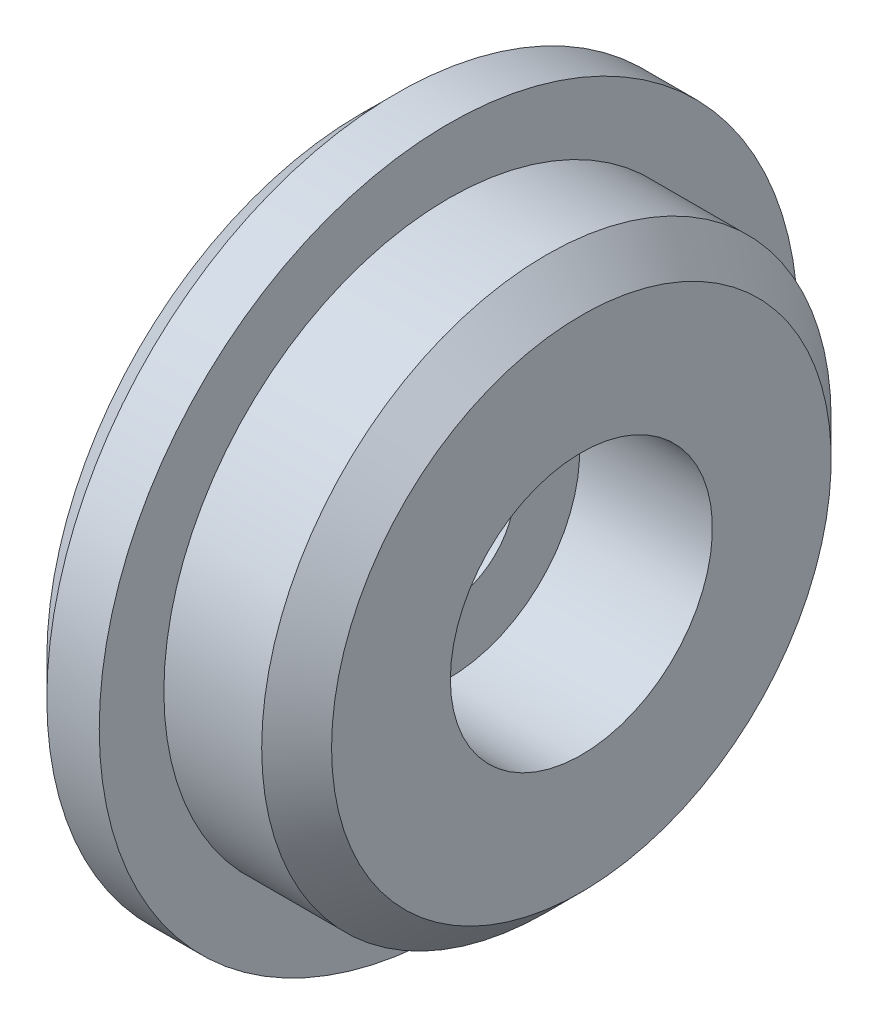
ISO-10303-21;
HEADER;
FILE_DESCRIPTION(('STEP AP214'),'2;1');
FILE_NAME('part.step','',(''),(''),'','','');
FILE_SCHEMA(('AUTOMOTIVE_DESIGN { 1 0 10303 214 1 1 1 1 }'));
ENDSEC;
DATA;
#1=APPLICATION_CONTEXT('core data for automotive mechanical design processes');
#2=APPLICATION_PROTOCOL_DEFINITION('international standard','automotive_design',2000,#1);
#3=PRODUCT_CONTEXT('',#1,'mechanical');
#4=PRODUCT('Part','Part','',(#3));
#5=PRODUCT_RELATED_PRODUCT_CATEGORY('part','',(#4));
#6=PRODUCT_DEFINITION_FORMATION('','',#4);
#7=PRODUCT_DEFINITION_CONTEXT('part definition',#1,'design');
#8=PRODUCT_DEFINITION('design','',#6,#7);
#9=PRODUCT_DEFINITION_SHAPE('','',#8);
#10=(LENGTH_UNIT() NAMED_UNIT(*) SI_UNIT(.MILLI.,.METRE.));
#11=(NAMED_UNIT(*) PLANE_ANGLE_UNIT() SI_UNIT($,.RADIAN.));
#12=(NAMED_UNIT(*) SI_UNIT($,.STERADIAN.) SOLID_ANGLE_UNIT());
#13=UNCERTAINTY_MEASURE_WITH_UNIT(LENGTH_MEASURE(1.E-05),#10,'distance_accuracy_value','');
#14=(GEOMETRIC_REPRESENTATION_CONTEXT(3) GLOBAL_UNCERTAINTY_ASSIGNED_CONTEXT((#13)) GLOBAL_UNIT_ASSIGNED_CONTEXT((#10,
#11,#12)) REPRESENTATION_CONTEXT('',''));
#15=CARTESIAN_POINT('',(0.,0.,0.));
#16=DIRECTION('',(0.,0.,1.));
#17=DIRECTION('',(1.,0.,0.));
#18=AXIS2_PLACEMENT_3D('',#15,#16,#17);
#19=CARTESIAN_POINT('',(-1.71917255102069,0.,0.));
#20=DIRECTION('',(-1.,0.,0.));
#21=DIRECTION('',(0.,0.,1.));
#22=AXIS2_PLACEMENT_3D('',#19,#20,#21);
#23=CYLINDRICAL_SURFACE('',#22,0.19);
#24=CARTESIAN_POINT('',(0.25,0.,0.));
#25=DIRECTION('',(-1.,0.,0.));
#26=DIRECTION('',(0.,0.,1.));
#27=AXIS2_PLACEMENT_3D('',#24,#25,#26);
#28=CIRCLE('',#27,0.19);
#29=CARTESIAN_POINT('',(0.25,0.,0.19));
#30=VERTEX_POINT('',#29);
#31=EDGE_CURVE('E88',#30,#30,#28,.T.);
#32=ORIENTED_EDGE('',*,*,#31,.F.);
#33=EDGE_LOOP('',(#32));
#34=FACE_BOUND('',#33,.T.);
#35=CARTESIAN_POINT('',(0.,0.,0.));
#36=DIRECTION('',(-1.,0.,0.));
#37=DIRECTION('',(0.,0.,1.));
#38=AXIS2_PLACEMENT_3D('',#35,#36,#37);
#39=CIRCLE('',#38,0.19);
#40=CARTESIAN_POINT('',(0.,0.,0.19));
#41=VERTEX_POINT('',#40);
#42=EDGE_CURVE('E68',#41,#41,#39,.T.);
#43=ORIENTED_EDGE('',*,*,#42,.T.);
#44=EDGE_LOOP('',(#43));
#45=FACE_BOUND('',#44,.T.);
#46=ADVANCED_FACE('F43',(#34,#45),#23,.F.);
#47=CARTESIAN_POINT('',(0.,0.19,0.));
#48=DIRECTION('',(1.,0.,0.));
#49=DIRECTION('',(0.,0.,-1.));
#50=AXIS2_PLACEMENT_3D('',#47,#48,#49);
#51=PLANE('',#50);
#52=CARTESIAN_POINT('',(0.,0.,0.));
#53=DIRECTION('',(1.,0.,0.));
#54=DIRECTION('',(0.,0.,-1.));
#55=AXIS2_PLACEMENT_3D('',#52,#53,#54);
#56=CIRCLE('',#55,0.9);
#57=CARTESIAN_POINT('',(0.,0.,-0.9));
#58=VERTEX_POINT('',#57);
#59=EDGE_CURVE('E62',#58,#58,#56,.F.);
#60=ORIENTED_EDGE('',*,*,#59,.T.);
#61=EDGE_LOOP('',(#60));
#62=FACE_BOUND('',#61,.T.);
#63=ORIENTED_EDGE('',*,*,#42,.F.);
#64=EDGE_LOOP('',(#63));
#65=FACE_BOUND('',#64,.T.);
#66=ADVANCED_FACE('F97',(#62,#65),#51,.F.);
#67=CARTESIAN_POINT('',(-1.71917255102069,0.,0.));
#68=DIRECTION('',(-1.,0.,0.));
#69=DIRECTION('',(0.,0.,1.));
#70=AXIS2_PLACEMENT_3D('',#67,#68,#69);
#71=CYLINDRICAL_SURFACE('',#70,1.);
#72=CARTESIAN_POINT('',(0.0999999999999998,0.,0.));
#73=DIRECTION('',(1.,0.,0.));
#74=DIRECTION('',(0.,0.,-1.));
#75=AXIS2_PLACEMENT_3D('',#72,#73,#74);
#76=CIRCLE('',#75,1.);
#77=CARTESIAN_POINT('',(0.0999999999999998,0.,-1.));
#78=VERTEX_POINT('',#77);
#79=EDGE_CURVE('E57',#78,#78,#76,.T.);
#80=ORIENTED_EDGE('',*,*,#79,.T.);
#81=EDGE_LOOP('',(#80));
#82=FACE_BOUND('',#81,.T.);
#83=CARTESIAN_POINT('',(0.25,0.,0.));
#84=DIRECTION('',(-1.,0.,0.));
#85=DIRECTION('',(0.,0.,1.));
#86=AXIS2_PLACEMENT_3D('',#83,#84,#85);
#87=CIRCLE('',#86,1.);
#88=CARTESIAN_POINT('',(0.25,0.,1.));
#89=VERTEX_POINT('',#88);
#90=EDGE_CURVE('E72',#89,#89,#87,.T.);
#91=ORIENTED_EDGE('',*,*,#90,.T.);
#92=EDGE_LOOP('',(#91));
#93=FACE_BOUND('',#92,.T.);
#94=ADVANCED_FACE('F102',(#82,#93),#71,.T.);
#95=CARTESIAN_POINT('',(0.25,1.,0.));
#96=DIRECTION('',(-1.,0.,0.));
#97=DIRECTION('',(0.,0.,1.));
#98=AXIS2_PLACEMENT_3D('',#95,#96,#97);
#99=PLANE('',#98);
#100=ORIENTED_EDGE('',*,*,#90,.F.);
#101=EDGE_LOOP('',(#100));
#102=FACE_BOUND('',#101,.T.);
#103=CARTESIAN_POINT('',(0.25,0.,0.));
#104=DIRECTION('',(-1.,0.,0.));
#105=DIRECTION('',(0.,0.,1.));
#106=AXIS2_PLACEMENT_3D('',#103,#104,#105);
#107=CIRCLE('',#106,0.815);
#108=CARTESIAN_POINT('',(0.25,0.,0.815));
#109=VERTEX_POINT('',#108);
#110=EDGE_CURVE('E76',#109,#109,#107,.T.);
#111=ORIENTED_EDGE('',*,*,#110,.T.);
#112=EDGE_LOOP('',(#111));
#113=FACE_BOUND('',#112,.T.);
#114=ADVANCED_FACE('F108',(#102,#113),#99,.F.);
#115=CARTESIAN_POINT('',(-1.71917255102069,0.,0.));
#116=DIRECTION('',(-1.,0.,0.));
#117=DIRECTION('',(0.,0.,1.));
#118=AXIS2_PLACEMENT_3D('',#115,#116,#117);
#119=CYLINDRICAL_SURFACE('',#118,0.815);
#120=CARTESIAN_POINT('',(0.53,0.,0.));
#121=DIRECTION('',(-1.,0.,0.));
#122=DIRECTION('',(0.,0.,1.));
#123=AXIS2_PLACEMENT_3D('',#120,#121,#122);
#124=CIRCLE('',#123,0.815);
#125=CARTESIAN_POINT('',(0.53,0.,0.815));
#126=VERTEX_POINT('',#125);
#127=EDGE_CURVE('E52',#126,#126,#124,.T.);
#128=ORIENTED_EDGE('',*,*,#127,.T.);
#129=EDGE_LOOP('',(#128));
#130=FACE_BOUND('',#129,.T.);
#131=ORIENTED_EDGE('',*,*,#110,.F.);
#132=EDGE_LOOP('',(#131));
#133=FACE_BOUND('',#132,.T.);
#134=ADVANCED_FACE('F134',(#130,#133),#119,.T.);
#135=CARTESIAN_POINT('',(0.63,0.815,0.));
#136=DIRECTION('',(-1.,0.,0.));
#137=DIRECTION('',(0.,0.,1.));
#138=AXIS2_PLACEMENT_3D('',#135,#136,#137);
#139=PLANE('',#138);
#140=CARTESIAN_POINT('',(0.63,0.,0.));
#141=DIRECTION('',(-1.,0.,0.));
#142=DIRECTION('',(0.,0.,1.));
#143=AXIS2_PLACEMENT_3D('',#140,#141,#142);
#144=CIRCLE('',#143,0.714999999999999);
#145=CARTESIAN_POINT('',(0.63,0.,0.714999999999999));
#146=VERTEX_POINT('',#145);
#147=EDGE_CURVE('E10',#146,#146,#144,.F.);
#148=ORIENTED_EDGE('',*,*,#147,.T.);
#149=EDGE_LOOP('',(#148));
#150=FACE_BOUND('',#149,.T.);
#151=CARTESIAN_POINT('',(0.63,0.,0.));
#152=DIRECTION('',(-1.,0.,0.));
#153=DIRECTION('',(0.,0.,1.));
#154=AXIS2_PLACEMENT_3D('',#151,#152,#153);
#155=CIRCLE('',#154,0.375);
#156=CARTESIAN_POINT('',(0.63,0.,0.375));
#157=VERTEX_POINT('',#156);
#158=EDGE_CURVE('E80',#157,#157,#155,.T.);
#159=ORIENTED_EDGE('',*,*,#158,.T.);
#160=EDGE_LOOP('',(#159));
#161=FACE_BOUND('',#160,.T.);
#162=ADVANCED_FACE('F138',(#150,#161),#139,.F.);
#163=CARTESIAN_POINT('',(-1.71917255102069,0.,0.));
#164=DIRECTION('',(-1.,0.,0.));
#165=DIRECTION('',(0.,0.,1.));
#166=AXIS2_PLACEMENT_3D('',#163,#164,#165);
#167=CYLINDRICAL_SURFACE('',#166,0.375);
#168=ORIENTED_EDGE('',*,*,#158,.F.);
#169=EDGE_LOOP('',(#168));
#170=FACE_BOUND('',#169,.T.);
#171=CARTESIAN_POINT('',(0.25,0.,0.));
#172=DIRECTION('',(-1.,0.,0.));
#173=DIRECTION('',(0.,0.,1.));
#174=AXIS2_PLACEMENT_3D('',#171,#172,#173);
#175=CIRCLE('',#174,0.375);
#176=CARTESIAN_POINT('',(0.25,0.,0.375));
#177=VERTEX_POINT('',#176);
#178=EDGE_CURVE('E84',#177,#177,#175,.T.);
#179=ORIENTED_EDGE('',*,*,#178,.T.);
#180=EDGE_LOOP('',(#179));
#181=FACE_BOUND('',#180,.T.);
#182=ADVANCED_FACE('F123',(#170,#181),#167,.F.);
#183=CARTESIAN_POINT('',(0.25,0.375,0.));
#184=DIRECTION('',(-1.,0.,0.));
#185=DIRECTION('',(0.,0.,1.));
#186=AXIS2_PLACEMENT_3D('',#183,#184,#185);
#187=PLANE('',#186);
#188=ORIENTED_EDGE('',*,*,#178,.F.);
#189=EDGE_LOOP('',(#188));
#190=FACE_BOUND('',#189,.T.);
#191=ORIENTED_EDGE('',*,*,#31,.T.);
#192=EDGE_LOOP('',(#191));
#193=FACE_BOUND('',#192,.T.);
#194=ADVANCED_FACE('F93',(#190,#193),#187,.F.);
#195=CARTESIAN_POINT('',(0.,0.,0.));
#196=DIRECTION('',(1.,0.,0.));
#197=DIRECTION('',(0.,0.,-1.));
#198=AXIS2_PLACEMENT_3D('',#195,#196,#197);
#199=CONICAL_SURFACE('',#198,0.9,0.78539816339745);
#200=ORIENTED_EDGE('',*,*,#79,.F.);
#201=EDGE_LOOP('',(#200));
#202=FACE_BOUND('',#201,.T.);
#203=ORIENTED_EDGE('',*,*,#59,.F.);
#204=EDGE_LOOP('',(#203));
#205=FACE_BOUND('',#204,.T.);
#206=ADVANCED_FACE('F113',(#202,#205),#199,.T.);
#207=CARTESIAN_POINT('',(0.53,0.,0.));
#208=DIRECTION('',(-1.,0.,0.));
#209=DIRECTION('',(0.,0.,1.));
#210=AXIS2_PLACEMENT_3D('',#207,#208,#209);
#211=CONICAL_SURFACE('',#210,0.815,0.78539816339745);
#212=ORIENTED_EDGE('',*,*,#147,.F.);
#213=EDGE_LOOP('',(#212));
#214=FACE_BOUND('',#213,.T.);
#215=ORIENTED_EDGE('',*,*,#127,.F.);
#216=EDGE_LOOP('',(#215));
#217=FACE_BOUND('',#216,.T.);
#218=ADVANCED_FACE('F46',(#214,#217),#211,.T.);
#219=CLOSED_SHELL('',(#46,#66,#94,#114,#134,#162,#182,#194,#206,#218));
#220=MANIFOLD_SOLID_BREP('B2',#219);
#221=ADVANCED_BREP_SHAPE_REPRESENTATION('',(#18,#220),#14);
#222=SHAPE_DEFINITION_REPRESENTATION(#9,#221);
ENDSEC;
END-ISO-10303-21;
